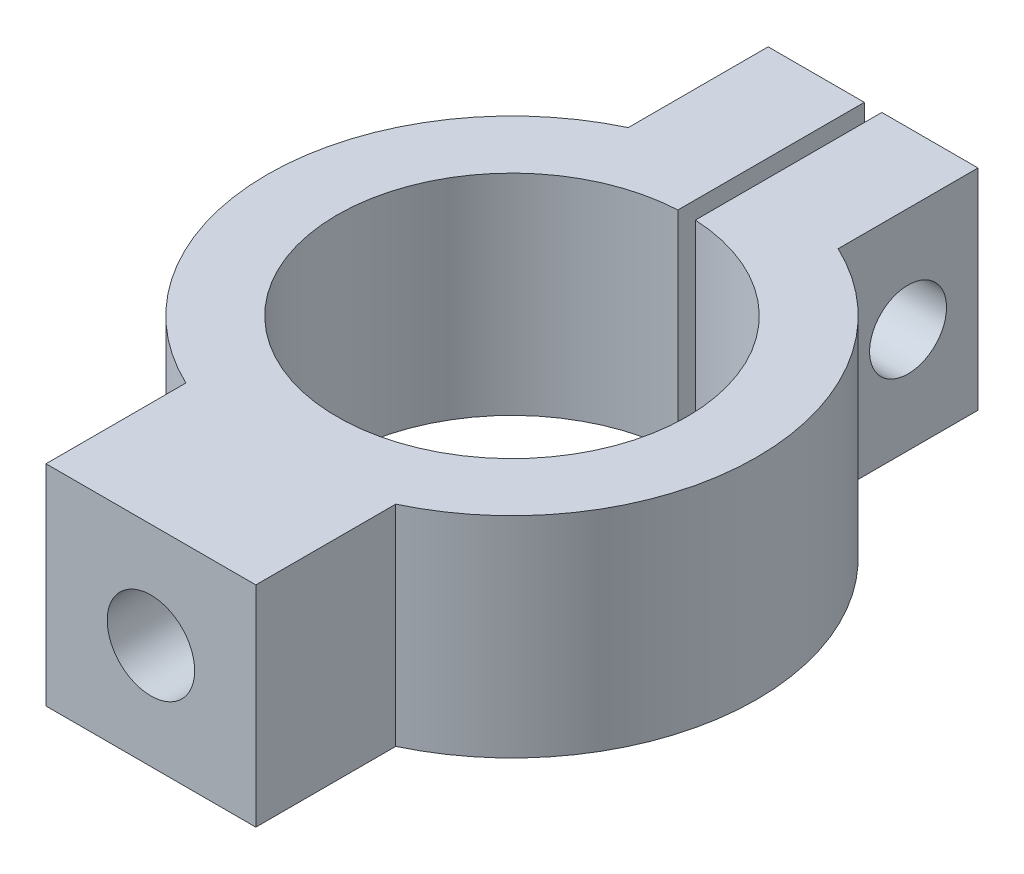
ISO-10303-21;
HEADER;
FILE_DESCRIPTION(('STEP AP214'),'2;1');
FILE_NAME('part.step','',(''),(''),'','','');
FILE_SCHEMA(('AUTOMOTIVE_DESIGN { 1 0 10303 214 1 1 1 1 }'));
ENDSEC;
DATA;
#1=APPLICATION_CONTEXT('core data for automotive mechanical design processes');
#2=APPLICATION_PROTOCOL_DEFINITION('international standard','automotive_design',2000,#1);
#3=PRODUCT_CONTEXT('',#1,'mechanical');
#4=PRODUCT('Part','Part','',(#3));
#5=PRODUCT_RELATED_PRODUCT_CATEGORY('part','',(#4));
#6=PRODUCT_DEFINITION_FORMATION('','',#4);
#7=PRODUCT_DEFINITION_CONTEXT('part definition',#1,'design');
#8=PRODUCT_DEFINITION('design','',#6,#7);
#9=PRODUCT_DEFINITION_SHAPE('','',#8);
#10=(LENGTH_UNIT() NAMED_UNIT(*) SI_UNIT(.MILLI.,.METRE.));
#11=(NAMED_UNIT(*) PLANE_ANGLE_UNIT() SI_UNIT($,.RADIAN.));
#12=(NAMED_UNIT(*) SI_UNIT($,.STERADIAN.) SOLID_ANGLE_UNIT());
#13=UNCERTAINTY_MEASURE_WITH_UNIT(LENGTH_MEASURE(1.E-05),#10,'distance_accuracy_value','');
#14=(GEOMETRIC_REPRESENTATION_CONTEXT(3) GLOBAL_UNCERTAINTY_ASSIGNED_CONTEXT((#13)) GLOBAL_UNIT_ASSIGNED_CONTEXT((#10,
#11,#12)) REPRESENTATION_CONTEXT('',''));
#15=CARTESIAN_POINT('',(0.,0.,0.));
#16=DIRECTION('',(0.,0.,1.));
#17=DIRECTION('',(1.,0.,0.));
#18=AXIS2_PLACEMENT_3D('',#15,#16,#17);
#19=CARTESIAN_POINT('',(-3.,13.211102550928,10.3245553203368));
#20=DIRECTION('',(0.,0.,-1.));
#21=DIRECTION('',(-1.,0.,0.));
#22=AXIS2_PLACEMENT_3D('',#19,#20,#21);
#23=PLANE('',#22);
#24=DIRECTION('',(1.,0.,0.));
#25=VECTOR('',#24,1.);
#26=CARTESIAN_POINT('',(-3.,6.,10.3245553203368));
#27=LINE('',#26,#25);
#28=CARTESIAN_POINT('',(-3.,6.,10.3245553203368));
#29=VERTEX_POINT('',#28);
#30=CARTESIAN_POINT('',(3.,6.,10.3245553203368));
#31=VERTEX_POINT('',#30);
#32=EDGE_CURVE('E209',#29,#31,#27,.T.);
#33=ORIENTED_EDGE('',*,*,#32,.F.);
#34=DIRECTION('',(0.,-1.,0.));
#35=VECTOR('',#34,1.);
#36=CARTESIAN_POINT('',(-3.,13.211102550928,10.3245553203368));
#37=LINE('',#36,#35);
#38=CARTESIAN_POINT('',(-3.,0.,10.3245553203368));
#39=VERTEX_POINT('',#38);
#40=EDGE_CURVE('E210',#29,#39,#37,.T.);
#41=ORIENTED_EDGE('',*,*,#40,.T.);
#42=DIRECTION('',(1.,0.,0.));
#43=VECTOR('',#42,1.);
#44=CARTESIAN_POINT('',(-3.,0.,10.3245553203368));
#45=LINE('',#44,#43);
#46=CARTESIAN_POINT('',(3.,0.,10.3245553203368));
#47=VERTEX_POINT('',#46);
#48=EDGE_CURVE('E206',#39,#47,#45,.T.);
#49=ORIENTED_EDGE('',*,*,#48,.T.);
#50=DIRECTION('',(0.,-1.,0.));
#51=VECTOR('',#50,1.);
#52=CARTESIAN_POINT('',(3.,13.211102550928,10.3245553203368));
#53=LINE('',#52,#51);
#54=EDGE_CURVE('E194',#31,#47,#53,.T.);
#55=ORIENTED_EDGE('',*,*,#54,.F.);
#56=EDGE_LOOP('',(#33,#41,#49,#55));
#57=FACE_BOUND('',#56,.T.);
#58=CARTESIAN_POINT('',(0.,3.,10.3245553203368));
#59=DIRECTION('',(0.,0.,1.));
#60=DIRECTION('',(1.,0.,0.));
#61=AXIS2_PLACEMENT_3D('',#58,#59,#60);
#62=CIRCLE('',#61,1.25);
#63=CARTESIAN_POINT('',(1.25,3.,10.3245553203368));
#64=VERTEX_POINT('',#63);
#65=EDGE_CURVE('E143',#64,#64,#62,.T.);
#66=ORIENTED_EDGE('',*,*,#65,.F.);
#67=EDGE_LOOP('',(#66));
#68=FACE_BOUND('',#67,.T.);
#69=ADVANCED_FACE('F40',(#57,#68),#23,.F.);
#70=CARTESIAN_POINT('',(0.,6.,0.));
#71=DIRECTION('',(0.,1.,0.));
#72=DIRECTION('',(0.,0.,1.));
#73=AXIS2_PLACEMENT_3D('',#70,#71,#72);
#74=PLANE('',#73);
#75=DIRECTION('',(-1.,0.,0.));
#76=VECTOR('',#75,1.);
#77=CARTESIAN_POINT('',(3.,6.,-10.3245553203368));
#78=LINE('',#77,#76);
#79=CARTESIAN_POINT('',(3.,6.,-10.3245553203368));
#80=VERTEX_POINT('',#79);
#81=CARTESIAN_POINT('',(0.25,6.,-10.3245553203368));
#82=VERTEX_POINT('',#81);
#83=EDGE_CURVE('E197',#80,#82,#78,.T.);
#84=ORIENTED_EDGE('',*,*,#83,.T.);
#85=DIRECTION('',(0.,0.,-1.));
#86=VECTOR('',#85,1.);
#87=CARTESIAN_POINT('',(0.25,6.,-4.99374608885955));
#88=LINE('',#87,#86);
#89=CARTESIAN_POINT('',(0.25,6.,-4.99374608885955));
#90=VERTEX_POINT('',#89);
#91=EDGE_CURVE('E65',#90,#82,#88,.T.);
#92=ORIENTED_EDGE('',*,*,#91,.F.);
#93=CARTESIAN_POINT('',(0.,6.,0.));
#94=DIRECTION('',(0.,1.,0.));
#95=DIRECTION('',(0.,0.,1.));
#96=AXIS2_PLACEMENT_3D('',#93,#94,#95);
#97=CIRCLE('',#96,5.);
#98=CARTESIAN_POINT('',(-0.25,6.,-4.99374608885955));
#99=VERTEX_POINT('',#98);
#100=EDGE_CURVE('E236',#99,#90,#97,.T.);
#101=ORIENTED_EDGE('',*,*,#100,.F.);
#102=DIRECTION('',(0.,0.,1.));
#103=VECTOR('',#102,1.);
#104=CARTESIAN_POINT('',(-0.25,6.,-4.99374608885955));
#105=LINE('',#104,#103);
#106=CARTESIAN_POINT('',(-0.25,6.,-10.3245553203368));
#107=VERTEX_POINT('',#106);
#108=EDGE_CURVE('E160',#107,#99,#105,.T.);
#109=ORIENTED_EDGE('',*,*,#108,.F.);
#110=CARTESIAN_POINT('',(-3.,6.,-10.3245553203368));
#111=VERTEX_POINT('',#110);
#112=EDGE_CURVE('E181',#107,#111,#78,.T.);
#113=ORIENTED_EDGE('',*,*,#112,.T.);
#114=DIRECTION('',(0.,0.,1.));
#115=VECTOR('',#114,1.);
#116=CARTESIAN_POINT('',(-3.,6.,-10.3245553203368));
#117=LINE('',#116,#115);
#118=CARTESIAN_POINT('',(-3.,6.,-6.32455532033676));
#119=VERTEX_POINT('',#118);
#120=EDGE_CURVE('E195',#111,#119,#117,.T.);
#121=ORIENTED_EDGE('',*,*,#120,.T.);
#122=CARTESIAN_POINT('',(0.,6.,0.));
#123=DIRECTION('',(0.,1.,0.));
#124=DIRECTION('',(0.,0.,1.));
#125=AXIS2_PLACEMENT_3D('',#122,#123,#124);
#126=CIRCLE('',#125,7.);
#127=CARTESIAN_POINT('',(-3.,6.,6.32455532033676));
#128=VERTEX_POINT('',#127);
#129=EDGE_CURVE('E49',#119,#128,#126,.T.);
#130=ORIENTED_EDGE('',*,*,#129,.T.);
#131=DIRECTION('',(0.,0.,1.));
#132=VECTOR('',#131,1.);
#133=CARTESIAN_POINT('',(-3.,6.,10.3245553203368));
#134=LINE('',#133,#132);
#135=EDGE_CURVE('E218',#128,#29,#134,.T.);
#136=ORIENTED_EDGE('',*,*,#135,.T.);
#137=ORIENTED_EDGE('',*,*,#32,.T.);
#138=DIRECTION('',(0.,0.,-1.));
#139=VECTOR('',#138,1.);
#140=CARTESIAN_POINT('',(3.,6.,10.3245553203368));
#141=LINE('',#140,#139);
#142=CARTESIAN_POINT('',(3.,6.,6.32455532033676));
#143=VERTEX_POINT('',#142);
#144=EDGE_CURVE('E222',#31,#143,#141,.T.);
#145=ORIENTED_EDGE('',*,*,#144,.T.);
#146=CARTESIAN_POINT('',(3.,6.,-6.32455532033676));
#147=VERTEX_POINT('',#146);
#148=EDGE_CURVE('E11',#143,#147,#126,.T.);
#149=ORIENTED_EDGE('',*,*,#148,.T.);
#150=DIRECTION('',(0.,0.,-1.));
#151=VECTOR('',#150,1.);
#152=CARTESIAN_POINT('',(3.,6.,-10.3245553203368));
#153=LINE('',#152,#151);
#154=EDGE_CURVE('E191',#147,#80,#153,.T.);
#155=ORIENTED_EDGE('',*,*,#154,.T.);
#156=EDGE_LOOP('',(#84,#92,#101,#109,#113,#121,#130,#136,#137,#145,#149,#155));
#157=FACE_BOUND('',#156,.T.);
#158=ADVANCED_FACE('F251',(#157),#74,.T.);
#159=CARTESIAN_POINT('',(0.,0.,0.));
#160=DIRECTION('',(0.,1.,0.));
#161=DIRECTION('',(0.,0.,1.));
#162=AXIS2_PLACEMENT_3D('',#159,#160,#161);
#163=PLANE('',#162);
#164=DIRECTION('',(0.,0.,-1.));
#165=VECTOR('',#164,1.);
#166=CARTESIAN_POINT('',(0.25,0.,-4.99374608885955));
#167=LINE('',#166,#165);
#168=CARTESIAN_POINT('',(0.25,0.,-4.99374608885955));
#169=VERTEX_POINT('',#168);
#170=CARTESIAN_POINT('',(0.25,0.,-10.3245553203368));
#171=VERTEX_POINT('',#170);
#172=EDGE_CURVE('E146',#169,#171,#167,.T.);
#173=ORIENTED_EDGE('',*,*,#172,.T.);
#174=DIRECTION('',(-1.,0.,0.));
#175=VECTOR('',#174,1.);
#176=CARTESIAN_POINT('',(3.,0.,-10.3245553203368));
#177=LINE('',#176,#175);
#178=CARTESIAN_POINT('',(3.,0.,-10.3245553203368));
#179=VERTEX_POINT('',#178);
#180=EDGE_CURVE('E178',#179,#171,#177,.T.);
#181=ORIENTED_EDGE('',*,*,#180,.F.);
#182=DIRECTION('',(0.,0.,-1.));
#183=VECTOR('',#182,1.);
#184=CARTESIAN_POINT('',(3.,0.,-10.3245553203368));
#185=LINE('',#184,#183);
#186=CARTESIAN_POINT('',(3.,0.,-6.32455532033676));
#187=VERTEX_POINT('',#186);
#188=EDGE_CURVE('E183',#187,#179,#185,.T.);
#189=ORIENTED_EDGE('',*,*,#188,.F.);
#190=CARTESIAN_POINT('',(0.,0.,0.));
#191=DIRECTION('',(0.,1.,0.));
#192=DIRECTION('',(0.,0.,1.));
#193=AXIS2_PLACEMENT_3D('',#190,#191,#192);
#194=CIRCLE('',#193,7.);
#195=CARTESIAN_POINT('',(3.,0.,6.32455532033676));
#196=VERTEX_POINT('',#195);
#197=EDGE_CURVE('E232',#196,#187,#194,.T.);
#198=ORIENTED_EDGE('',*,*,#197,.F.);
#199=DIRECTION('',(0.,0.,-1.));
#200=VECTOR('',#199,1.);
#201=CARTESIAN_POINT('',(3.,0.,10.3245553203368));
#202=LINE('',#201,#200);
#203=EDGE_CURVE('E215',#47,#196,#202,.T.);
#204=ORIENTED_EDGE('',*,*,#203,.F.);
#205=ORIENTED_EDGE('',*,*,#48,.F.);
#206=DIRECTION('',(0.,0.,1.));
#207=VECTOR('',#206,1.);
#208=CARTESIAN_POINT('',(-3.,0.,10.3245553203368));
#209=LINE('',#208,#207);
#210=CARTESIAN_POINT('',(-3.,0.,6.32455532033676));
#211=VERTEX_POINT('',#210);
#212=EDGE_CURVE('E211',#211,#39,#209,.T.);
#213=ORIENTED_EDGE('',*,*,#212,.F.);
#214=CARTESIAN_POINT('',(-3.,0.,-6.32455532033676));
#215=VERTEX_POINT('',#214);
#216=EDGE_CURVE('E235',#215,#211,#194,.T.);
#217=ORIENTED_EDGE('',*,*,#216,.F.);
#218=DIRECTION('',(0.,0.,1.));
#219=VECTOR('',#218,1.);
#220=CARTESIAN_POINT('',(-3.,0.,-10.3245553203368));
#221=LINE('',#220,#219);
#222=CARTESIAN_POINT('',(-3.,0.,-10.3245553203368));
#223=VERTEX_POINT('',#222);
#224=EDGE_CURVE('E188',#223,#215,#221,.T.);
#225=ORIENTED_EDGE('',*,*,#224,.F.);
#226=CARTESIAN_POINT('',(-0.25,0.,-10.3245553203368));
#227=VERTEX_POINT('',#226);
#228=EDGE_CURVE('E182',#227,#223,#177,.T.);
#229=ORIENTED_EDGE('',*,*,#228,.F.);
#230=DIRECTION('',(0.,0.,1.));
#231=VECTOR('',#230,1.);
#232=CARTESIAN_POINT('',(-0.25,0.,-4.99374608885955));
#233=LINE('',#232,#231);
#234=CARTESIAN_POINT('',(-0.25,0.,-4.99374608885955));
#235=VERTEX_POINT('',#234);
#236=EDGE_CURVE('E57',#227,#235,#233,.T.);
#237=ORIENTED_EDGE('',*,*,#236,.T.);
#238=CARTESIAN_POINT('',(0.,0.,0.));
#239=DIRECTION('',(0.,1.,0.));
#240=DIRECTION('',(0.,0.,1.));
#241=AXIS2_PLACEMENT_3D('',#238,#239,#240);
#242=CIRCLE('',#241,5.);
#243=EDGE_CURVE('E221',#235,#169,#242,.T.);
#244=ORIENTED_EDGE('',*,*,#243,.T.);
#245=EDGE_LOOP('',(#173,#181,#189,#198,#204,#205,#213,#217,#225,#229,#237,#244));
#246=FACE_BOUND('',#245,.T.);
#247=ADVANCED_FACE('F243',(#246),#163,.F.);
#248=CARTESIAN_POINT('',(0.,6.,0.));
#249=DIRECTION('',(0.,-1.,0.));
#250=DIRECTION('',(0.,0.,-1.));
#251=AXIS2_PLACEMENT_3D('',#248,#249,#250);
#252=CYLINDRICAL_SURFACE('',#251,5.);
#253=ORIENTED_EDGE('',*,*,#100,.T.);
#254=DIRECTION('',(0.,-1.,0.));
#255=VECTOR('',#254,1.);
#256=CARTESIAN_POINT('',(0.25,11.3542064829816,-4.99374608885955));
#257=LINE('',#256,#255);
#258=EDGE_CURVE('E142',#90,#169,#257,.T.);
#259=ORIENTED_EDGE('',*,*,#258,.T.);
#260=ORIENTED_EDGE('',*,*,#243,.F.);
#261=DIRECTION('',(0.,-1.,0.));
#262=VECTOR('',#261,1.);
#263=CARTESIAN_POINT('',(-0.25,11.3542064829816,-4.99374608885955));
#264=LINE('',#263,#262);
#265=EDGE_CURVE('E161',#99,#235,#264,.T.);
#266=ORIENTED_EDGE('',*,*,#265,.F.);
#267=EDGE_LOOP('',(#253,#259,#260,#266));
#268=FACE_BOUND('',#267,.T.);
#269=ADVANCED_FACE('F248',(#268),#252,.F.);
#270=CARTESIAN_POINT('',(3.,13.211102550928,-10.3245553203368));
#271=DIRECTION('',(0.,0.,1.));
#272=DIRECTION('',(1.,0.,0.));
#273=AXIS2_PLACEMENT_3D('',#270,#271,#272);
#274=PLANE('',#273);
#275=DIRECTION('',(0.,-1.,0.));
#276=VECTOR('',#275,1.);
#277=CARTESIAN_POINT('',(0.25,11.3542064829816,-10.3245553203368));
#278=LINE('',#277,#276);
#279=EDGE_CURVE('E153',#82,#171,#278,.T.);
#280=ORIENTED_EDGE('',*,*,#279,.F.);
#281=ORIENTED_EDGE('',*,*,#83,.F.);
#282=DIRECTION('',(0.,-1.,0.));
#283=VECTOR('',#282,1.);
#284=CARTESIAN_POINT('',(3.,13.211102550928,-10.3245553203368));
#285=LINE('',#284,#283);
#286=EDGE_CURVE('E186',#80,#179,#285,.T.);
#287=ORIENTED_EDGE('',*,*,#286,.T.);
#288=ORIENTED_EDGE('',*,*,#180,.T.);
#289=EDGE_LOOP('',(#280,#281,#287,#288));
#290=FACE_BOUND('',#289,.T.);
#291=ADVANCED_FACE('F255',(#290),#274,.F.);
#292=DIRECTION('',(0.,-1.,0.));
#293=VECTOR('',#292,1.);
#294=CARTESIAN_POINT('',(-0.25,11.3542064829816,-10.3245553203368));
#295=LINE('',#294,#293);
#296=EDGE_CURVE('E155',#107,#227,#295,.T.);
#297=ORIENTED_EDGE('',*,*,#296,.T.);
#298=ORIENTED_EDGE('',*,*,#228,.T.);
#299=DIRECTION('',(0.,-1.,0.));
#300=VECTOR('',#299,1.);
#301=CARTESIAN_POINT('',(-3.,13.211102550928,-10.3245553203368));
#302=LINE('',#301,#300);
#303=EDGE_CURVE('E168',#111,#223,#302,.T.);
#304=ORIENTED_EDGE('',*,*,#303,.F.);
#305=ORIENTED_EDGE('',*,*,#112,.F.);
#306=EDGE_LOOP('',(#297,#298,#304,#305));
#307=FACE_BOUND('',#306,.T.);
#308=ADVANCED_FACE('F288',(#307),#274,.F.);
#309=CARTESIAN_POINT('',(0.,6.,0.));
#310=DIRECTION('',(0.,-1.,0.));
#311=DIRECTION('',(0.,0.,-1.));
#312=AXIS2_PLACEMENT_3D('',#309,#310,#311);
#313=CYLINDRICAL_SURFACE('',#312,7.);
#314=DIRECTION('',(0.,-1.,0.));
#315=VECTOR('',#314,1.);
#316=CARTESIAN_POINT('',(-3.,13.211102550928,-6.32455532033676));
#317=LINE('',#316,#315);
#318=EDGE_CURVE('E190',#119,#215,#317,.T.);
#319=ORIENTED_EDGE('',*,*,#318,.T.);
#320=ORIENTED_EDGE('',*,*,#216,.T.);
#321=DIRECTION('',(0.,-1.,0.));
#322=VECTOR('',#321,1.);
#323=CARTESIAN_POINT('',(-3.,13.211102550928,6.32455532033676));
#324=LINE('',#323,#322);
#325=EDGE_CURVE('E214',#128,#211,#324,.T.);
#326=ORIENTED_EDGE('',*,*,#325,.F.);
#327=ORIENTED_EDGE('',*,*,#129,.F.);
#328=EDGE_LOOP('',(#319,#320,#326,#327));
#329=FACE_BOUND('',#328,.T.);
#330=ADVANCED_FACE('F42',(#329),#313,.T.);
#331=DIRECTION('',(0.,-1.,0.));
#332=VECTOR('',#331,1.);
#333=CARTESIAN_POINT('',(3.,13.211102550928,-6.32455532033676));
#334=LINE('',#333,#332);
#335=EDGE_CURVE('E187',#147,#187,#334,.T.);
#336=ORIENTED_EDGE('',*,*,#335,.F.);
#337=ORIENTED_EDGE('',*,*,#148,.F.);
#338=DIRECTION('',(0.,-1.,0.));
#339=VECTOR('',#338,1.);
#340=CARTESIAN_POINT('',(3.,13.211102550928,6.32455532033676));
#341=LINE('',#340,#339);
#342=EDGE_CURVE('E217',#143,#196,#341,.T.);
#343=ORIENTED_EDGE('',*,*,#342,.T.);
#344=ORIENTED_EDGE('',*,*,#197,.T.);
#345=EDGE_LOOP('',(#336,#337,#343,#344));
#346=FACE_BOUND('',#345,.T.);
#347=ADVANCED_FACE('F262',(#346),#313,.T.);
#348=CARTESIAN_POINT('',(3.,13.211102550928,10.3245553203368));
#349=DIRECTION('',(-1.,0.,0.));
#350=DIRECTION('',(0.,0.,1.));
#351=AXIS2_PLACEMENT_3D('',#348,#349,#350);
#352=PLANE('',#351);
#353=ORIENTED_EDGE('',*,*,#144,.F.);
#354=ORIENTED_EDGE('',*,*,#54,.T.);
#355=ORIENTED_EDGE('',*,*,#203,.T.);
#356=ORIENTED_EDGE('',*,*,#342,.F.);
#357=EDGE_LOOP('',(#353,#354,#355,#356));
#358=FACE_BOUND('',#357,.T.);
#359=ADVANCED_FACE('F267',(#358),#352,.F.);
#360=CARTESIAN_POINT('',(-3.,13.211102550928,10.3245553203368));
#361=DIRECTION('',(1.,0.,0.));
#362=DIRECTION('',(0.,0.,-1.));
#363=AXIS2_PLACEMENT_3D('',#360,#361,#362);
#364=PLANE('',#363);
#365=ORIENTED_EDGE('',*,*,#135,.F.);
#366=ORIENTED_EDGE('',*,*,#325,.T.);
#367=ORIENTED_EDGE('',*,*,#212,.T.);
#368=ORIENTED_EDGE('',*,*,#40,.F.);
#369=EDGE_LOOP('',(#365,#366,#367,#368));
#370=FACE_BOUND('',#369,.T.);
#371=ADVANCED_FACE('F276',(#370),#364,.F.);
#372=CARTESIAN_POINT('',(-3.,13.211102550928,-10.3245553203368));
#373=DIRECTION('',(1.,0.,0.));
#374=DIRECTION('',(0.,0.,-1.));
#375=AXIS2_PLACEMENT_3D('',#372,#373,#374);
#376=PLANE('',#375);
#377=CARTESIAN_POINT('',(-3.,3.,-8.32455532033676));
#378=DIRECTION('',(1.,0.,0.));
#379=DIRECTION('',(0.,0.,-1.));
#380=AXIS2_PLACEMENT_3D('',#377,#378,#379);
#381=CIRCLE('',#380,0.799999999999999);
#382=CARTESIAN_POINT('',(-3.,3.,-9.12455532033676));
#383=VERTEX_POINT('',#382);
#384=EDGE_CURVE('E465',#383,#383,#381,.F.);
#385=ORIENTED_EDGE('',*,*,#384,.F.);
#386=EDGE_LOOP('',(#385));
#387=FACE_BOUND('',#386,.T.);
#388=ORIENTED_EDGE('',*,*,#120,.F.);
#389=ORIENTED_EDGE('',*,*,#303,.T.);
#390=ORIENTED_EDGE('',*,*,#224,.T.);
#391=ORIENTED_EDGE('',*,*,#318,.F.);
#392=EDGE_LOOP('',(#388,#389,#390,#391));
#393=FACE_BOUND('',#392,.T.);
#394=ADVANCED_FACE('F284',(#387,#393),#376,.F.);
#395=CARTESIAN_POINT('',(3.,13.211102550928,-10.3245553203368));
#396=DIRECTION('',(-1.,0.,0.));
#397=DIRECTION('',(0.,0.,1.));
#398=AXIS2_PLACEMENT_3D('',#395,#396,#397);
#399=PLANE('',#398);
#400=CARTESIAN_POINT('',(3.,3.,-8.32455532033676));
#401=DIRECTION('',(1.,0.,0.));
#402=DIRECTION('',(0.,0.,-1.));
#403=AXIS2_PLACEMENT_3D('',#400,#401,#402);
#404=CIRCLE('',#403,1.1);
#405=CARTESIAN_POINT('',(3.,3.,-9.42455532033676));
#406=VERTEX_POINT('',#405);
#407=EDGE_CURVE('E469',#406,#406,#404,.T.);
#408=ORIENTED_EDGE('',*,*,#407,.F.);
#409=EDGE_LOOP('',(#408));
#410=FACE_BOUND('',#409,.T.);
#411=ORIENTED_EDGE('',*,*,#154,.F.);
#412=ORIENTED_EDGE('',*,*,#335,.T.);
#413=ORIENTED_EDGE('',*,*,#188,.T.);
#414=ORIENTED_EDGE('',*,*,#286,.F.);
#415=EDGE_LOOP('',(#411,#412,#413,#414));
#416=FACE_BOUND('',#415,.T.);
#417=ADVANCED_FACE('F291',(#410,#416),#399,.F.);
#418=CARTESIAN_POINT('',(-0.25,11.3542064829816,-4.99374608885955));
#419=DIRECTION('',(1.,0.,0.));
#420=DIRECTION('',(0.,0.,-1.));
#421=AXIS2_PLACEMENT_3D('',#418,#419,#420);
#422=PLANE('',#421);
#423=CARTESIAN_POINT('',(-0.25,3.,-8.32455532033676));
#424=DIRECTION('',(1.,0.,0.));
#425=DIRECTION('',(0.,0.,-1.));
#426=AXIS2_PLACEMENT_3D('',#423,#424,#425);
#427=CIRCLE('',#426,0.799999999999999);
#428=CARTESIAN_POINT('',(-0.25,3.,-9.12455532033676));
#429=VERTEX_POINT('',#428);
#430=EDGE_CURVE('E467',#429,#429,#427,.T.);
#431=ORIENTED_EDGE('',*,*,#430,.F.);
#432=EDGE_LOOP('',(#431));
#433=FACE_BOUND('',#432,.T.);
#434=ORIENTED_EDGE('',*,*,#108,.T.);
#435=ORIENTED_EDGE('',*,*,#265,.T.);
#436=ORIENTED_EDGE('',*,*,#236,.F.);
#437=ORIENTED_EDGE('',*,*,#296,.F.);
#438=EDGE_LOOP('',(#434,#435,#436,#437));
#439=FACE_BOUND('',#438,.T.);
#440=ADVANCED_FACE('F289',(#433,#439),#422,.T.);
#441=CARTESIAN_POINT('',(0.25,11.3542064829816,-4.99374608885955));
#442=DIRECTION('',(-1.,0.,0.));
#443=DIRECTION('',(0.,0.,1.));
#444=AXIS2_PLACEMENT_3D('',#441,#442,#443);
#445=PLANE('',#444);
#446=CARTESIAN_POINT('',(0.25,3.,-8.32455532033676));
#447=DIRECTION('',(-1.,0.,0.));
#448=DIRECTION('',(0.,0.,1.));
#449=AXIS2_PLACEMENT_3D('',#446,#447,#448);
#450=CIRCLE('',#449,1.1);
#451=CARTESIAN_POINT('',(0.25,3.,-7.22455532033676));
#452=VERTEX_POINT('',#451);
#453=EDGE_CURVE('E149',#452,#452,#450,.F.);
#454=ORIENTED_EDGE('',*,*,#453,.T.);
#455=EDGE_LOOP('',(#454));
#456=FACE_BOUND('',#455,.T.);
#457=ORIENTED_EDGE('',*,*,#91,.T.);
#458=ORIENTED_EDGE('',*,*,#279,.T.);
#459=ORIENTED_EDGE('',*,*,#172,.F.);
#460=ORIENTED_EDGE('',*,*,#258,.F.);
#461=EDGE_LOOP('',(#457,#458,#459,#460));
#462=FACE_BOUND('',#461,.T.);
#463=ADVANCED_FACE('F136',(#456,#462),#445,.T.);
#464=CARTESIAN_POINT('',(0.,3.,6.32455532033676));
#465=DIRECTION('',(0.,0.,1.));
#466=DIRECTION('',(1.,0.,0.));
#467=AXIS2_PLACEMENT_3D('',#464,#465,#466);
#468=CONICAL_SURFACE('',#467,1.25,1.02974425867665);
#469=CARTESIAN_POINT('',(0.,3.,5.57347954655231));
#470=VERTEX_POINT('',#469);
#471=VERTEX_LOOP('',#470);
#472=FACE_BOUND('',#471,.T.);
#473=CARTESIAN_POINT('',(0.,3.,6.32455532033676));
#474=DIRECTION('',(0.,0.,1.));
#475=DIRECTION('',(1.,0.,0.));
#476=AXIS2_PLACEMENT_3D('',#473,#474,#475);
#477=CIRCLE('',#476,1.25);
#478=CARTESIAN_POINT('',(1.25,3.,6.32455532033676));
#479=VERTEX_POINT('',#478);
#480=EDGE_CURVE('E140',#479,#479,#477,.T.);
#481=ORIENTED_EDGE('',*,*,#480,.T.);
#482=EDGE_LOOP('',(#481));
#483=FACE_BOUND('',#482,.T.);
#484=ADVANCED_FACE('F132',(#472,#483),#468,.F.);
#485=CARTESIAN_POINT('',(0.,3.,10.3245553203368));
#486=DIRECTION('',(0.,0.,1.));
#487=DIRECTION('',(1.,0.,0.));
#488=AXIS2_PLACEMENT_3D('',#485,#486,#487);
#489=CYLINDRICAL_SURFACE('',#488,1.25);
#490=ORIENTED_EDGE('',*,*,#480,.F.);
#491=EDGE_LOOP('',(#490));
#492=FACE_BOUND('',#491,.T.);
#493=ORIENTED_EDGE('',*,*,#65,.T.);
#494=EDGE_LOOP('',(#493));
#495=FACE_BOUND('',#494,.T.);
#496=ADVANCED_FACE('F135',(#492,#495),#489,.F.);
#497=CARTESIAN_POINT('',(3.,3.,-8.32455532033676));
#498=DIRECTION('',(1.,0.,0.));
#499=DIRECTION('',(0.,0.,-1.));
#500=AXIS2_PLACEMENT_3D('',#497,#498,#499);
#501=CYLINDRICAL_SURFACE('',#500,1.1);
#502=ORIENTED_EDGE('',*,*,#453,.F.);
#503=EDGE_LOOP('',(#502));
#504=FACE_BOUND('',#503,.T.);
#505=ORIENTED_EDGE('',*,*,#407,.T.);
#506=EDGE_LOOP('',(#505));
#507=FACE_BOUND('',#506,.T.);
#508=ADVANCED_FACE('F384',(#504,#507),#501,.F.);
#509=CARTESIAN_POINT('',(-0.25,3.,-8.32455532033676));
#510=DIRECTION('',(1.,0.,0.));
#511=DIRECTION('',(0.,0.,-1.));
#512=AXIS2_PLACEMENT_3D('',#509,#510,#511);
#513=CYLINDRICAL_SURFACE('',#512,0.799999999999999);
#514=ORIENTED_EDGE('',*,*,#384,.T.);
#515=EDGE_LOOP('',(#514));
#516=FACE_BOUND('',#515,.T.);
#517=ORIENTED_EDGE('',*,*,#430,.T.);
#518=EDGE_LOOP('',(#517));
#519=FACE_BOUND('',#518,.T.);
#520=ADVANCED_FACE('F388',(#516,#519),#513,.F.);
#521=CLOSED_SHELL('',(#69,#158,#247,#269,#291,#308,#330,#347,#359,#371,#394,#417,#440,#463,#484,
#496,#508,#520));
#522=MANIFOLD_SOLID_BREP('B2',#521);
#523=ADVANCED_BREP_SHAPE_REPRESENTATION('',(#18,#522),#14);
#524=SHAPE_DEFINITION_REPRESENTATION(#9,#523);
ENDSEC;
END-ISO-10303-21;
